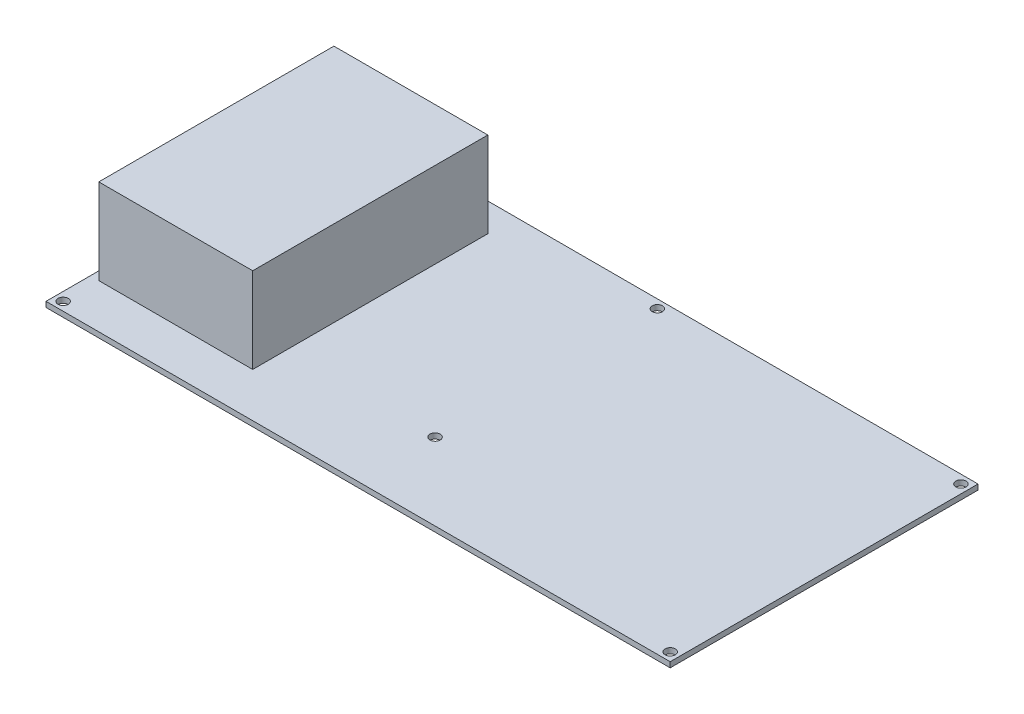
ISO-10303-21;
HEADER;
FILE_DESCRIPTION(('STEP AP214'),'2;1');
FILE_NAME('part.step','',(''),(''),'','','');
FILE_SCHEMA(('AUTOMOTIVE_DESIGN { 1 0 10303 214 1 1 1 1 }'));
ENDSEC;
DATA;
#1=APPLICATION_CONTEXT('core data for automotive mechanical design processes');
#2=APPLICATION_PROTOCOL_DEFINITION('international standard','automotive_design',2000,#1);
#3=PRODUCT_CONTEXT('',#1,'mechanical');
#4=PRODUCT('Part','Part','',(#3));
#5=PRODUCT_RELATED_PRODUCT_CATEGORY('part','',(#4));
#6=PRODUCT_DEFINITION_FORMATION('','',#4);
#7=PRODUCT_DEFINITION_CONTEXT('part definition',#1,'design');
#8=PRODUCT_DEFINITION('design','',#6,#7);
#9=PRODUCT_DEFINITION_SHAPE('','',#8);
#10=(LENGTH_UNIT() NAMED_UNIT(*) SI_UNIT(.MILLI.,.METRE.));
#11=(NAMED_UNIT(*) PLANE_ANGLE_UNIT() SI_UNIT($,.RADIAN.));
#12=(NAMED_UNIT(*) SI_UNIT($,.STERADIAN.) SOLID_ANGLE_UNIT());
#13=UNCERTAINTY_MEASURE_WITH_UNIT(LENGTH_MEASURE(1.E-05),#10,'distance_accuracy_value','');
#14=(GEOMETRIC_REPRESENTATION_CONTEXT(3) GLOBAL_UNCERTAINTY_ASSIGNED_CONTEXT((#13)) GLOBAL_UNIT_ASSIGNED_CONTEXT((#10,
#11,#12)) REPRESENTATION_CONTEXT('',''));
#15=CARTESIAN_POINT('',(0.,0.,0.));
#16=DIRECTION('',(0.,0.,1.));
#17=DIRECTION('',(1.,0.,0.));
#18=AXIS2_PLACEMENT_3D('',#15,#16,#17);
#19=CARTESIAN_POINT('',(0.,1.5875,0.));
#20=DIRECTION('',(0.,1.,0.));
#21=DIRECTION('',(0.,0.,1.));
#22=AXIS2_PLACEMENT_3D('',#19,#20,#21);
#23=PLANE('',#22);
#24=CARTESIAN_POINT('',(-93.5304462143857,1.5875,40.3680939947781));
#25=DIRECTION('',(0.,1.,0.));
#26=DIRECTION('',(0.,0.,1.));
#27=AXIS2_PLACEMENT_3D('',#24,#25,#26);
#28=CIRCLE('',#27,1.52400000000005);
#29=CARTESIAN_POINT('',(-93.5304462143857,1.5875,41.8920939947781));
#30=VERTEX_POINT('',#29);
#31=EDGE_CURVE('E156',#30,#30,#28,.T.);
#32=ORIENTED_EDGE('',*,*,#31,.F.);
#33=EDGE_LOOP('',(#32));
#34=FACE_BOUND('',#33,.T.);
#35=CARTESIAN_POINT('',(86.8095537856143,1.5875,40.3680939947781));
#36=DIRECTION('',(0.,1.,0.));
#37=DIRECTION('',(0.,0.,1.));
#38=AXIS2_PLACEMENT_3D('',#35,#36,#37);
#39=CIRCLE('',#38,1.52400000000001);
#40=CARTESIAN_POINT('',(86.8095537856143,1.5875,41.8920939947781));
#41=VERTEX_POINT('',#40);
#42=EDGE_CURVE('E172',#41,#41,#39,.T.);
#43=ORIENTED_EDGE('',*,*,#42,.F.);
#44=EDGE_LOOP('',(#43));
#45=FACE_BOUND('',#44,.T.);
#46=CARTESIAN_POINT('',(-93.5304462143857,1.5875,-45.9919060052219));
#47=DIRECTION('',(0.,1.,0.));
#48=DIRECTION('',(0.,0.,1.));
#49=AXIS2_PLACEMENT_3D('',#46,#47,#48);
#50=CIRCLE('',#49,1.52400000000001);
#51=CARTESIAN_POINT('',(-93.5304462143857,1.5875,-44.4679060052219));
#52=VERTEX_POINT('',#51);
#53=EDGE_CURVE('E188',#52,#52,#50,.T.);
#54=ORIENTED_EDGE('',*,*,#53,.F.);
#55=EDGE_LOOP('',(#54));
#56=FACE_BOUND('',#55,.T.);
#57=DIRECTION('',(0.,0.,1.));
#58=VECTOR('',#57,1.);
#59=CARTESIAN_POINT('',(-96.0704462143857,1.5875,-48.5319060052219));
#60=LINE('',#59,#58);
#61=CARTESIAN_POINT('',(-96.0704462143857,1.5875,-48.5319060052219));
#62=VERTEX_POINT('',#61);
#63=CARTESIAN_POINT('',(-96.0704462143857,1.5875,42.9080939947781));
#64=VERTEX_POINT('',#63);
#65=EDGE_CURVE('E196',#62,#64,#60,.T.);
#66=ORIENTED_EDGE('',*,*,#65,.T.);
#67=DIRECTION('',(1.,0.,0.));
#68=VECTOR('',#67,1.);
#69=CARTESIAN_POINT('',(-96.0704462143857,1.5875,42.9080939947781));
#70=LINE('',#69,#68);
#71=CARTESIAN_POINT('',(89.3495537856143,1.5875,42.9080939947781));
#72=VERTEX_POINT('',#71);
#73=EDGE_CURVE('E92',#64,#72,#70,.T.);
#74=ORIENTED_EDGE('',*,*,#73,.T.);
#75=DIRECTION('',(0.,0.,-1.));
#76=VECTOR('',#75,1.);
#77=CARTESIAN_POINT('',(89.3495537856143,1.5875,-48.5319060052219));
#78=LINE('',#77,#76);
#79=CARTESIAN_POINT('',(89.3495537856143,1.5875,-48.5319060052219));
#80=VERTEX_POINT('',#79);
#81=EDGE_CURVE('E201',#72,#80,#78,.T.);
#82=ORIENTED_EDGE('',*,*,#81,.T.);
#83=DIRECTION('',(-1.,0.,0.));
#84=VECTOR('',#83,1.);
#85=CARTESIAN_POINT('',(-96.0704462143857,1.5875,-48.5319060052219));
#86=LINE('',#85,#84);
#87=EDGE_CURVE('E64',#80,#62,#86,.T.);
#88=ORIENTED_EDGE('',*,*,#87,.T.);
#89=EDGE_LOOP('',(#66,#74,#82,#88));
#90=FACE_BOUND('',#89,.T.);
#91=CARTESIAN_POINT('',(86.8095537856143,1.5875,-45.9919060052219));
#92=DIRECTION('',(0.,1.,0.));
#93=DIRECTION('',(0.,0.,1.));
#94=AXIS2_PLACEMENT_3D('',#91,#92,#93);
#95=CIRCLE('',#94,1.52400000000001);
#96=CARTESIAN_POINT('',(86.8095537856143,1.5875,-44.4679060052219));
#97=VERTEX_POINT('',#96);
#98=EDGE_CURVE('E180',#97,#97,#95,.T.);
#99=ORIENTED_EDGE('',*,*,#98,.F.);
#100=EDGE_LOOP('',(#99));
#101=FACE_BOUND('',#100,.T.);
#102=CARTESIAN_POINT('',(-3.36044621438572,1.5875,20.0480939947781));
#103=DIRECTION('',(0.,1.,0.));
#104=DIRECTION('',(0.,0.,1.));
#105=AXIS2_PLACEMENT_3D('',#102,#103,#104);
#106=CIRCLE('',#105,1.52400000000001);
#107=CARTESIAN_POINT('',(-3.36044621438572,1.5875,21.5720939947781));
#108=VERTEX_POINT('',#107);
#109=EDGE_CURVE('E164',#108,#108,#106,.T.);
#110=ORIENTED_EDGE('',*,*,#109,.F.);
#111=EDGE_LOOP('',(#110));
#112=FACE_BOUND('',#111,.T.);
#113=CARTESIAN_POINT('',(-3.36044621438571,1.5875,-45.9919060052219));
#114=DIRECTION('',(0.,1.,0.));
#115=DIRECTION('',(0.,0.,1.));
#116=AXIS2_PLACEMENT_3D('',#113,#114,#115);
#117=CIRCLE('',#116,1.524);
#118=CARTESIAN_POINT('',(-3.36044621438571,1.5875,-44.4679060052219));
#119=VERTEX_POINT('',#118);
#120=EDGE_CURVE('E147',#119,#119,#117,.T.);
#121=ORIENTED_EDGE('',*,*,#120,.F.);
#122=EDGE_LOOP('',(#121));
#123=FACE_BOUND('',#122,.T.);
#124=DIRECTION('',(1.,0.,0.));
#125=VECTOR('',#124,1.);
#126=CARTESIAN_POINT('',(-93.5627507993011,1.5875,29.7360617446583));
#127=LINE('',#126,#125);
#128=CARTESIAN_POINT('',(-93.5627507993011,1.5875,29.7360617446583));
#129=VERTEX_POINT('',#128);
#130=CARTESIAN_POINT('',(-47.8427507993011,1.5875,29.7360617446583));
#131=VERTEX_POINT('',#130);
#132=EDGE_CURVE('E399',#129,#131,#127,.T.);
#133=ORIENTED_EDGE('',*,*,#132,.F.);
#134=DIRECTION('',(0.,0.,1.));
#135=VECTOR('',#134,1.);
#136=CARTESIAN_POINT('',(-93.5627507993011,1.5875,-40.1139382553417));
#137=LINE('',#136,#135);
#138=CARTESIAN_POINT('',(-93.5627507993011,1.5875,-40.1139382553417));
#139=VERTEX_POINT('',#138);
#140=EDGE_CURVE('E139',#139,#129,#137,.T.);
#141=ORIENTED_EDGE('',*,*,#140,.F.);
#142=DIRECTION('',(-1.,0.,0.));
#143=VECTOR('',#142,1.);
#144=CARTESIAN_POINT('',(-93.5627507993011,1.5875,-40.1139382553417));
#145=LINE('',#144,#143);
#146=CARTESIAN_POINT('',(-47.8427507993011,1.5875,-40.1139382553417));
#147=VERTEX_POINT('',#146);
#148=EDGE_CURVE('E135',#147,#139,#145,.T.);
#149=ORIENTED_EDGE('',*,*,#148,.F.);
#150=DIRECTION('',(0.,0.,-1.));
#151=VECTOR('',#150,1.);
#152=CARTESIAN_POINT('',(-47.8427507993011,1.5875,-40.1139382553417));
#153=LINE('',#152,#151);
#154=EDGE_CURVE('E395',#131,#147,#153,.T.);
#155=ORIENTED_EDGE('',*,*,#154,.F.);
#156=EDGE_LOOP('',(#133,#141,#149,#155));
#157=FACE_BOUND('',#156,.T.);
#158=ADVANCED_FACE('F39',(#34,#45,#56,#90,#101,#112,#123,#157),#23,.T.);
#159=CARTESIAN_POINT('',(0.,0.,0.));
#160=DIRECTION('',(0.,1.,0.));
#161=DIRECTION('',(0.,0.,1.));
#162=AXIS2_PLACEMENT_3D('',#159,#160,#161);
#163=PLANE('',#162);
#164=DIRECTION('',(0.,0.,1.));
#165=VECTOR('',#164,1.);
#166=CARTESIAN_POINT('',(-96.0704462143857,0.,-48.5319060052219));
#167=LINE('',#166,#165);
#168=CARTESIAN_POINT('',(-96.0704462143857,0.,-48.5319060052219));
#169=VERTEX_POINT('',#168);
#170=CARTESIAN_POINT('',(-96.0704462143857,0.,42.9080939947781));
#171=VERTEX_POINT('',#170);
#172=EDGE_CURVE('E192',#169,#171,#167,.T.);
#173=ORIENTED_EDGE('',*,*,#172,.F.);
#174=DIRECTION('',(-1.,0.,0.));
#175=VECTOR('',#174,1.);
#176=CARTESIAN_POINT('',(-96.0704462143857,0.,-48.5319060052219));
#177=LINE('',#176,#175);
#178=CARTESIAN_POINT('',(89.3495537856143,0.,-48.5319060052219));
#179=VERTEX_POINT('',#178);
#180=EDGE_CURVE('E85',#179,#169,#177,.T.);
#181=ORIENTED_EDGE('',*,*,#180,.F.);
#182=DIRECTION('',(0.,0.,-1.));
#183=VECTOR('',#182,1.);
#184=CARTESIAN_POINT('',(89.3495537856143,0.,-48.5319060052219));
#185=LINE('',#184,#183);
#186=CARTESIAN_POINT('',(89.3495537856143,0.,42.9080939947781));
#187=VERTEX_POINT('',#186);
#188=EDGE_CURVE('E213',#187,#179,#185,.T.);
#189=ORIENTED_EDGE('',*,*,#188,.F.);
#190=DIRECTION('',(1.,0.,0.));
#191=VECTOR('',#190,1.);
#192=CARTESIAN_POINT('',(-96.0704462143857,0.,42.9080939947781));
#193=LINE('',#192,#191);
#194=EDGE_CURVE('E210',#171,#187,#193,.T.);
#195=ORIENTED_EDGE('',*,*,#194,.F.);
#196=EDGE_LOOP('',(#173,#181,#189,#195));
#197=FACE_BOUND('',#196,.T.);
#198=CARTESIAN_POINT('',(-93.5304462143857,0.,-45.9919060052219));
#199=DIRECTION('',(0.,1.,0.));
#200=DIRECTION('',(0.,0.,1.));
#201=AXIS2_PLACEMENT_3D('',#198,#199,#200);
#202=CIRCLE('',#201,1.52400000000001);
#203=CARTESIAN_POINT('',(-93.5304462143857,0.,-44.4679060052219));
#204=VERTEX_POINT('',#203);
#205=EDGE_CURVE('E184',#204,#204,#202,.T.);
#206=ORIENTED_EDGE('',*,*,#205,.T.);
#207=EDGE_LOOP('',(#206));
#208=FACE_BOUND('',#207,.T.);
#209=CARTESIAN_POINT('',(86.8095537856143,0.,-45.9919060052219));
#210=DIRECTION('',(0.,1.,0.));
#211=DIRECTION('',(0.,0.,1.));
#212=AXIS2_PLACEMENT_3D('',#209,#210,#211);
#213=CIRCLE('',#212,1.52400000000001);
#214=CARTESIAN_POINT('',(86.8095537856143,0.,-44.4679060052219));
#215=VERTEX_POINT('',#214);
#216=EDGE_CURVE('E176',#215,#215,#213,.T.);
#217=ORIENTED_EDGE('',*,*,#216,.T.);
#218=EDGE_LOOP('',(#217));
#219=FACE_BOUND('',#218,.T.);
#220=CARTESIAN_POINT('',(86.8095537856143,0.,40.3680939947781));
#221=DIRECTION('',(0.,1.,0.));
#222=DIRECTION('',(0.,0.,1.));
#223=AXIS2_PLACEMENT_3D('',#220,#221,#222);
#224=CIRCLE('',#223,1.52400000000001);
#225=CARTESIAN_POINT('',(86.8095537856143,0.,41.8920939947781));
#226=VERTEX_POINT('',#225);
#227=EDGE_CURVE('E168',#226,#226,#224,.T.);
#228=ORIENTED_EDGE('',*,*,#227,.T.);
#229=EDGE_LOOP('',(#228));
#230=FACE_BOUND('',#229,.T.);
#231=CARTESIAN_POINT('',(-3.36044621438572,0.,20.0480939947781));
#232=DIRECTION('',(0.,1.,0.));
#233=DIRECTION('',(0.,0.,1.));
#234=AXIS2_PLACEMENT_3D('',#231,#232,#233);
#235=CIRCLE('',#234,1.52400000000001);
#236=CARTESIAN_POINT('',(-3.36044621438572,0.,21.5720939947781));
#237=VERTEX_POINT('',#236);
#238=EDGE_CURVE('E160',#237,#237,#235,.T.);
#239=ORIENTED_EDGE('',*,*,#238,.T.);
#240=EDGE_LOOP('',(#239));
#241=FACE_BOUND('',#240,.T.);
#242=CARTESIAN_POINT('',(-93.5304462143857,0.,40.3680939947781));
#243=DIRECTION('',(0.,1.,0.));
#244=DIRECTION('',(0.,0.,1.));
#245=AXIS2_PLACEMENT_3D('',#242,#243,#244);
#246=CIRCLE('',#245,1.52400000000005);
#247=CARTESIAN_POINT('',(-93.5304462143857,0.,41.8920939947781));
#248=VERTEX_POINT('',#247);
#249=EDGE_CURVE('E154',#248,#248,#246,.T.);
#250=ORIENTED_EDGE('',*,*,#249,.T.);
#251=EDGE_LOOP('',(#250));
#252=FACE_BOUND('',#251,.T.);
#253=CARTESIAN_POINT('',(-3.36044621438571,0.,-45.9919060052219));
#254=DIRECTION('',(0.,1.,0.));
#255=DIRECTION('',(0.,0.,1.));
#256=AXIS2_PLACEMENT_3D('',#253,#254,#255);
#257=CIRCLE('',#256,1.524);
#258=CARTESIAN_POINT('',(-3.36044621438571,0.,-44.4679060052219));
#259=VERTEX_POINT('',#258);
#260=EDGE_CURVE('E142',#259,#259,#257,.T.);
#261=ORIENTED_EDGE('',*,*,#260,.T.);
#262=EDGE_LOOP('',(#261));
#263=FACE_BOUND('',#262,.T.);
#264=ADVANCED_FACE('F231',(#197,#208,#219,#230,#241,#252,#263),#163,.F.);
#265=CARTESIAN_POINT('',(-96.0704462143857,1.5875,-48.5319060052219));
#266=DIRECTION('',(1.,0.,0.));
#267=DIRECTION('',(0.,0.,-1.));
#268=AXIS2_PLACEMENT_3D('',#265,#266,#267);
#269=PLANE('',#268);
#270=ORIENTED_EDGE('',*,*,#172,.T.);
#271=DIRECTION('',(0.,-1.,0.));
#272=VECTOR('',#271,1.);
#273=CARTESIAN_POINT('',(-96.0704462143857,1.5875,42.9080939947781));
#274=LINE('',#273,#272);
#275=EDGE_CURVE('E11',#64,#171,#274,.T.);
#276=ORIENTED_EDGE('',*,*,#275,.F.);
#277=ORIENTED_EDGE('',*,*,#65,.F.);
#278=DIRECTION('',(0.,-1.,0.));
#279=VECTOR('',#278,1.);
#280=CARTESIAN_POINT('',(-96.0704462143857,1.5875,-48.5319060052219));
#281=LINE('',#280,#279);
#282=EDGE_CURVE('E206',#62,#169,#281,.T.);
#283=ORIENTED_EDGE('',*,*,#282,.T.);
#284=EDGE_LOOP('',(#270,#276,#277,#283));
#285=FACE_BOUND('',#284,.T.);
#286=ADVANCED_FACE('F41',(#285),#269,.F.);
#287=CARTESIAN_POINT('',(-96.0704462143857,1.5875,42.9080939947781));
#288=DIRECTION('',(0.,0.,-1.));
#289=DIRECTION('',(-1.,0.,0.));
#290=AXIS2_PLACEMENT_3D('',#287,#288,#289);
#291=PLANE('',#290);
#292=ORIENTED_EDGE('',*,*,#194,.T.);
#293=DIRECTION('',(0.,-1.,0.));
#294=VECTOR('',#293,1.);
#295=CARTESIAN_POINT('',(89.3495537856143,1.5875,42.9080939947781));
#296=LINE('',#295,#294);
#297=EDGE_CURVE('E48',#72,#187,#296,.T.);
#298=ORIENTED_EDGE('',*,*,#297,.F.);
#299=ORIENTED_EDGE('',*,*,#73,.F.);
#300=ORIENTED_EDGE('',*,*,#275,.T.);
#301=EDGE_LOOP('',(#292,#298,#299,#300));
#302=FACE_BOUND('',#301,.T.);
#303=ADVANCED_FACE('F247',(#302),#291,.F.);
#304=CARTESIAN_POINT('',(89.3495537856143,1.5875,-48.5319060052219));
#305=DIRECTION('',(-1.,0.,0.));
#306=DIRECTION('',(0.,0.,1.));
#307=AXIS2_PLACEMENT_3D('',#304,#305,#306);
#308=PLANE('',#307);
#309=ORIENTED_EDGE('',*,*,#188,.T.);
#310=DIRECTION('',(0.,-1.,0.));
#311=VECTOR('',#310,1.);
#312=CARTESIAN_POINT('',(89.3495537856143,1.5875,-48.5319060052219));
#313=LINE('',#312,#311);
#314=EDGE_CURVE('E220',#80,#179,#313,.T.);
#315=ORIENTED_EDGE('',*,*,#314,.F.);
#316=ORIENTED_EDGE('',*,*,#81,.F.);
#317=ORIENTED_EDGE('',*,*,#297,.T.);
#318=EDGE_LOOP('',(#309,#315,#316,#317));
#319=FACE_BOUND('',#318,.T.);
#320=ADVANCED_FACE('F227',(#319),#308,.F.);
#321=CARTESIAN_POINT('',(-96.0704462143857,1.5875,-48.5319060052219));
#322=DIRECTION('',(0.,0.,1.));
#323=DIRECTION('',(1.,0.,0.));
#324=AXIS2_PLACEMENT_3D('',#321,#322,#323);
#325=PLANE('',#324);
#326=ORIENTED_EDGE('',*,*,#180,.T.);
#327=ORIENTED_EDGE('',*,*,#282,.F.);
#328=ORIENTED_EDGE('',*,*,#87,.F.);
#329=ORIENTED_EDGE('',*,*,#314,.T.);
#330=EDGE_LOOP('',(#326,#327,#328,#329));
#331=FACE_BOUND('',#330,.T.);
#332=ADVANCED_FACE('F236',(#331),#325,.F.);
#333=CARTESIAN_POINT('',(-93.5304462143857,1.5875,-45.9919060052219));
#334=DIRECTION('',(0.,-1.,0.));
#335=DIRECTION('',(0.,0.,-1.));
#336=AXIS2_PLACEMENT_3D('',#333,#334,#335);
#337=CYLINDRICAL_SURFACE('',#336,1.52400000000001);
#338=ORIENTED_EDGE('',*,*,#53,.T.);
#339=EDGE_LOOP('',(#338));
#340=FACE_BOUND('',#339,.T.);
#341=ORIENTED_EDGE('',*,*,#205,.F.);
#342=EDGE_LOOP('',(#341));
#343=FACE_BOUND('',#342,.T.);
#344=ADVANCED_FACE('F238',(#340,#343),#337,.F.);
#345=CARTESIAN_POINT('',(86.8095537856143,1.5875,-45.9919060052219));
#346=DIRECTION('',(0.,-1.,0.));
#347=DIRECTION('',(0.,0.,-1.));
#348=AXIS2_PLACEMENT_3D('',#345,#346,#347);
#349=CYLINDRICAL_SURFACE('',#348,1.52400000000001);
#350=ORIENTED_EDGE('',*,*,#98,.T.);
#351=EDGE_LOOP('',(#350));
#352=FACE_BOUND('',#351,.T.);
#353=ORIENTED_EDGE('',*,*,#216,.F.);
#354=EDGE_LOOP('',(#353));
#355=FACE_BOUND('',#354,.T.);
#356=ADVANCED_FACE('F244',(#352,#355),#349,.F.);
#357=CARTESIAN_POINT('',(86.8095537856143,1.5875,40.3680939947781));
#358=DIRECTION('',(0.,-1.,0.));
#359=DIRECTION('',(0.,0.,-1.));
#360=AXIS2_PLACEMENT_3D('',#357,#358,#359);
#361=CYLINDRICAL_SURFACE('',#360,1.52400000000001);
#362=ORIENTED_EDGE('',*,*,#42,.T.);
#363=EDGE_LOOP('',(#362));
#364=FACE_BOUND('',#363,.T.);
#365=ORIENTED_EDGE('',*,*,#227,.F.);
#366=EDGE_LOOP('',(#365));
#367=FACE_BOUND('',#366,.T.);
#368=ADVANCED_FACE('F261',(#364,#367),#361,.F.);
#369=CARTESIAN_POINT('',(-3.36044621438572,1.5875,20.0480939947781));
#370=DIRECTION('',(0.,-1.,0.));
#371=DIRECTION('',(0.,0.,-1.));
#372=AXIS2_PLACEMENT_3D('',#369,#370,#371);
#373=CYLINDRICAL_SURFACE('',#372,1.52400000000001);
#374=ORIENTED_EDGE('',*,*,#109,.T.);
#375=EDGE_LOOP('',(#374));
#376=FACE_BOUND('',#375,.T.);
#377=ORIENTED_EDGE('',*,*,#238,.F.);
#378=EDGE_LOOP('',(#377));
#379=FACE_BOUND('',#378,.T.);
#380=ADVANCED_FACE('F265',(#376,#379),#373,.F.);
#381=CARTESIAN_POINT('',(-93.5304462143857,1.5875,40.3680939947781));
#382=DIRECTION('',(0.,-1.,0.));
#383=DIRECTION('',(0.,0.,-1.));
#384=AXIS2_PLACEMENT_3D('',#381,#382,#383);
#385=CYLINDRICAL_SURFACE('',#384,1.52400000000005);
#386=ORIENTED_EDGE('',*,*,#31,.T.);
#387=EDGE_LOOP('',(#386));
#388=FACE_BOUND('',#387,.T.);
#389=ORIENTED_EDGE('',*,*,#249,.F.);
#390=EDGE_LOOP('',(#389));
#391=FACE_BOUND('',#390,.T.);
#392=ADVANCED_FACE('F269',(#388,#391),#385,.F.);
#393=CARTESIAN_POINT('',(-3.36044621438571,1.5875,-45.9919060052219));
#394=DIRECTION('',(0.,-1.,0.));
#395=DIRECTION('',(0.,0.,-1.));
#396=AXIS2_PLACEMENT_3D('',#393,#394,#395);
#397=CYLINDRICAL_SURFACE('',#396,1.524);
#398=ORIENTED_EDGE('',*,*,#120,.T.);
#399=EDGE_LOOP('',(#398));
#400=FACE_BOUND('',#399,.T.);
#401=ORIENTED_EDGE('',*,*,#260,.F.);
#402=EDGE_LOOP('',(#401));
#403=FACE_BOUND('',#402,.T.);
#404=ADVANCED_FACE('F273',(#400,#403),#397,.F.);
#405=CARTESIAN_POINT('',(-93.5627507993011,26.9875,-40.1139382553417));
#406=DIRECTION('',(1.,0.,0.));
#407=DIRECTION('',(0.,0.,-1.));
#408=AXIS2_PLACEMENT_3D('',#405,#406,#407);
#409=PLANE('',#408);
#410=ORIENTED_EDGE('',*,*,#140,.T.);
#411=DIRECTION('',(0.,-1.,0.));
#412=VECTOR('',#411,1.);
#413=CARTESIAN_POINT('',(-93.5627507993011,26.9875,29.7360617446583));
#414=LINE('',#413,#412);
#415=CARTESIAN_POINT('',(-93.5627507993011,26.9875,29.7360617446583));
#416=VERTEX_POINT('',#415);
#417=EDGE_CURVE('E118',#416,#129,#414,.T.);
#418=ORIENTED_EDGE('',*,*,#417,.F.);
#419=DIRECTION('',(0.,0.,1.));
#420=VECTOR('',#419,1.);
#421=CARTESIAN_POINT('',(-93.5627507993011,26.9875,-40.1139382553417));
#422=LINE('',#421,#420);
#423=CARTESIAN_POINT('',(-93.5627507993011,26.9875,-40.1139382553417));
#424=VERTEX_POINT('',#423);
#425=EDGE_CURVE('E126',#424,#416,#422,.T.);
#426=ORIENTED_EDGE('',*,*,#425,.F.);
#427=DIRECTION('',(0.,-1.,0.));
#428=VECTOR('',#427,1.);
#429=CARTESIAN_POINT('',(-93.5627507993011,26.9875,-40.1139382553417));
#430=LINE('',#429,#428);
#431=EDGE_CURVE('E391',#424,#139,#430,.T.);
#432=ORIENTED_EDGE('',*,*,#431,.T.);
#433=EDGE_LOOP('',(#410,#418,#426,#432));
#434=FACE_BOUND('',#433,.T.);
#435=ADVANCED_FACE('F137',(#434),#409,.F.);
#436=CARTESIAN_POINT('',(-93.5627507993011,26.9875,29.7360617446583));
#437=DIRECTION('',(0.,0.,-1.));
#438=DIRECTION('',(-1.,0.,0.));
#439=AXIS2_PLACEMENT_3D('',#436,#437,#438);
#440=PLANE('',#439);
#441=ORIENTED_EDGE('',*,*,#132,.T.);
#442=DIRECTION('',(0.,-1.,0.));
#443=VECTOR('',#442,1.);
#444=CARTESIAN_POINT('',(-47.8427507993011,26.9875,29.7360617446583));
#445=LINE('',#444,#443);
#446=CARTESIAN_POINT('',(-47.8427507993011,26.9875,29.7360617446583));
#447=VERTEX_POINT('',#446);
#448=EDGE_CURVE('E121',#447,#131,#445,.T.);
#449=ORIENTED_EDGE('',*,*,#448,.F.);
#450=DIRECTION('',(1.,0.,0.));
#451=VECTOR('',#450,1.);
#452=CARTESIAN_POINT('',(-93.5627507993011,26.9875,29.7360617446583));
#453=LINE('',#452,#451);
#454=EDGE_CURVE('E114',#416,#447,#453,.T.);
#455=ORIENTED_EDGE('',*,*,#454,.F.);
#456=ORIENTED_EDGE('',*,*,#417,.T.);
#457=EDGE_LOOP('',(#441,#449,#455,#456));
#458=FACE_BOUND('',#457,.T.);
#459=ADVANCED_FACE('F116',(#458),#440,.F.);
#460=CARTESIAN_POINT('',(-47.8427507993011,26.9875,-40.1139382553417));
#461=DIRECTION('',(-1.,0.,0.));
#462=DIRECTION('',(0.,0.,1.));
#463=AXIS2_PLACEMENT_3D('',#460,#461,#462);
#464=PLANE('',#463);
#465=ORIENTED_EDGE('',*,*,#154,.T.);
#466=DIRECTION('',(0.,-1.,0.));
#467=VECTOR('',#466,1.);
#468=CARTESIAN_POINT('',(-47.8427507993011,26.9875,-40.1139382553417));
#469=LINE('',#468,#467);
#470=CARTESIAN_POINT('',(-47.8427507993011,26.9875,-40.1139382553417));
#471=VERTEX_POINT('',#470);
#472=EDGE_CURVE('E55',#471,#147,#469,.T.);
#473=ORIENTED_EDGE('',*,*,#472,.F.);
#474=DIRECTION('',(0.,0.,-1.));
#475=VECTOR('',#474,1.);
#476=CARTESIAN_POINT('',(-47.8427507993011,26.9875,-40.1139382553417));
#477=LINE('',#476,#475);
#478=EDGE_CURVE('E125',#447,#471,#477,.T.);
#479=ORIENTED_EDGE('',*,*,#478,.F.);
#480=ORIENTED_EDGE('',*,*,#448,.T.);
#481=EDGE_LOOP('',(#465,#473,#479,#480));
#482=FACE_BOUND('',#481,.T.);
#483=ADVANCED_FACE('F282',(#482),#464,.F.);
#484=CARTESIAN_POINT('',(-93.5627507993011,26.9875,-40.1139382553417));
#485=DIRECTION('',(0.,0.,1.));
#486=DIRECTION('',(1.,0.,0.));
#487=AXIS2_PLACEMENT_3D('',#484,#485,#486);
#488=PLANE('',#487);
#489=ORIENTED_EDGE('',*,*,#148,.T.);
#490=ORIENTED_EDGE('',*,*,#431,.F.);
#491=DIRECTION('',(-1.,0.,0.));
#492=VECTOR('',#491,1.);
#493=CARTESIAN_POINT('',(-93.5627507993011,26.9875,-40.1139382553417));
#494=LINE('',#493,#492);
#495=EDGE_CURVE('E130',#471,#424,#494,.T.);
#496=ORIENTED_EDGE('',*,*,#495,.F.);
#497=ORIENTED_EDGE('',*,*,#472,.T.);
#498=EDGE_LOOP('',(#489,#490,#496,#497));
#499=FACE_BOUND('',#498,.T.);
#500=ADVANCED_FACE('F285',(#499),#488,.F.);
#501=CARTESIAN_POINT('',(0.,26.9875,0.));
#502=DIRECTION('',(0.,1.,0.));
#503=DIRECTION('',(0.,0.,1.));
#504=AXIS2_PLACEMENT_3D('',#501,#502,#503);
#505=PLANE('',#504);
#506=ORIENTED_EDGE('',*,*,#425,.T.);
#507=ORIENTED_EDGE('',*,*,#454,.T.);
#508=ORIENTED_EDGE('',*,*,#478,.T.);
#509=ORIENTED_EDGE('',*,*,#495,.T.);
#510=EDGE_LOOP('',(#506,#507,#508,#509));
#511=FACE_BOUND('',#510,.T.);
#512=ADVANCED_FACE('F129',(#511),#505,.T.);
#513=CLOSED_SHELL('',(#158,#264,#286,#303,#320,#332,#344,#356,#368,#380,#392,#404,#435,#459,
#483,#500,#512));
#514=MANIFOLD_SOLID_BREP('B2',#513);
#515=ADVANCED_BREP_SHAPE_REPRESENTATION('',(#18,#514),#14);
#516=SHAPE_DEFINITION_REPRESENTATION(#9,#515);
ENDSEC;
END-ISO-10303-21;
